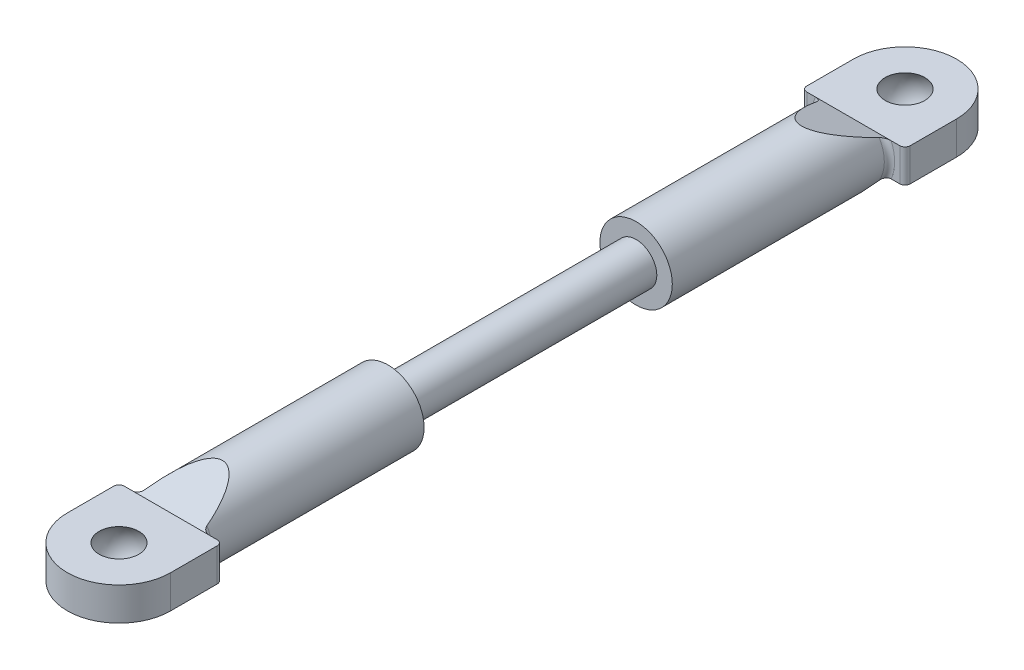
ISO-10303-21;
HEADER;
FILE_DESCRIPTION(('STEP AP214'),'2;1');
FILE_NAME('part.step','',(''),(''),'','','');
FILE_SCHEMA(('AUTOMOTIVE_DESIGN { 1 0 10303 214 1 1 1 1 }'));
ENDSEC;
DATA;
#1=APPLICATION_CONTEXT('core data for automotive mechanical design processes');
#2=APPLICATION_PROTOCOL_DEFINITION('international standard','automotive_design',2000,#1);
#3=PRODUCT_CONTEXT('',#1,'mechanical');
#4=PRODUCT('Part','Part','',(#3));
#5=PRODUCT_RELATED_PRODUCT_CATEGORY('part','',(#4));
#6=PRODUCT_DEFINITION_FORMATION('','',#4);
#7=PRODUCT_DEFINITION_CONTEXT('part definition',#1,'design');
#8=PRODUCT_DEFINITION('design','',#6,#7);
#9=PRODUCT_DEFINITION_SHAPE('','',#8);
#10=(LENGTH_UNIT() NAMED_UNIT(*) SI_UNIT(.MILLI.,.METRE.));
#11=(NAMED_UNIT(*) PLANE_ANGLE_UNIT() SI_UNIT($,.RADIAN.));
#12=(NAMED_UNIT(*) SI_UNIT($,.STERADIAN.) SOLID_ANGLE_UNIT());
#13=UNCERTAINTY_MEASURE_WITH_UNIT(LENGTH_MEASURE(1.E-05),#10,'distance_accuracy_value','');
#14=(GEOMETRIC_REPRESENTATION_CONTEXT(3) GLOBAL_UNCERTAINTY_ASSIGNED_CONTEXT((#13)) GLOBAL_UNIT_ASSIGNED_CONTEXT((#10,
#11,#12)) REPRESENTATION_CONTEXT('',''));
#15=CARTESIAN_POINT('',(0.,0.,0.));
#16=DIRECTION('',(0.,0.,1.));
#17=DIRECTION('',(1.,0.,0.));
#18=AXIS2_PLACEMENT_3D('',#15,#16,#17);
#19=CARTESIAN_POINT('',(0.,0.,-33.));
#20=DIRECTION('',(0.,0.,1.));
#21=DIRECTION('',(1.,0.,0.));
#22=AXIS2_PLACEMENT_3D('',#19,#20,#21);
#23=CYLINDRICAL_SURFACE('',#22,3.5);
#24=CARTESIAN_POINT('',(0.,0.,-12.));
#25=DIRECTION('',(0.,0.,1.));
#26=DIRECTION('',(1.,0.,0.));
#27=AXIS2_PLACEMENT_3D('',#24,#25,#26);
#28=CIRCLE('',#27,3.5);
#29=CARTESIAN_POINT('',(3.5,0.,-12.));
#30=VERTEX_POINT('',#29);
#31=EDGE_CURVE('E184',#30,#30,#28,.T.);
#32=ORIENTED_EDGE('',*,*,#31,.F.);
#33=EDGE_LOOP('',(#32));
#34=FACE_BOUND('',#33,.T.);
#35=CARTESIAN_POINT('',(0.,0.,-37.2105263157895));
#36=DIRECTION('',(0.,0.934783580588349,-0.355217760623573));
#37=DIRECTION('',(0.,0.355217760623573,0.934783580588349));
#38=AXIS2_PLACEMENT_3D('',#35,#36,#37);
#39=ELLIPSE('',#38,9.8531109307594,3.5);
#40=CARTESIAN_POINT('',(3.00764027104307,1.79,-32.5));
#41=VERTEX_POINT('',#40);
#42=CARTESIAN_POINT('',(-3.00764027104307,1.79,-32.5));
#43=VERTEX_POINT('',#42);
#44=EDGE_CURVE('E517',#41,#43,#39,.F.);
#45=ORIENTED_EDGE('',*,*,#44,.T.);
#46=CARTESIAN_POINT('',(0.,0.,-32.5));
#47=DIRECTION('',(0.,0.,1.));
#48=DIRECTION('',(1.,0.,0.));
#49=AXIS2_PLACEMENT_3D('',#46,#47,#48);
#50=CIRCLE('',#49,3.5);
#51=CARTESIAN_POINT('',(-3.00764027104307,-1.79,-32.5));
#52=VERTEX_POINT('',#51);
#53=EDGE_CURVE('E369',#43,#52,#50,.T.);
#54=ORIENTED_EDGE('',*,*,#53,.T.);
#55=CARTESIAN_POINT('',(0.,0.,-37.2105263157895));
#56=DIRECTION('',(0.,-0.934783580588349,-0.355217760623573));
#57=DIRECTION('',(0.,-0.355217760623573,0.934783580588349));
#58=AXIS2_PLACEMENT_3D('',#55,#56,#57);
#59=ELLIPSE('',#58,9.8531109307594,3.5);
#60=CARTESIAN_POINT('',(3.00764027104307,-1.79,-32.5));
#61=VERTEX_POINT('',#60);
#62=EDGE_CURVE('E208',#52,#61,#59,.F.);
#63=ORIENTED_EDGE('',*,*,#62,.T.);
#64=CARTESIAN_POINT('',(0.,0.,-32.5));
#65=DIRECTION('',(0.,0.,1.));
#66=DIRECTION('',(1.,0.,0.));
#67=AXIS2_PLACEMENT_3D('',#64,#65,#66);
#68=CIRCLE('',#67,3.5);
#69=EDGE_CURVE('E366',#61,#41,#68,.T.);
#70=ORIENTED_EDGE('',*,*,#69,.T.);
#71=EDGE_LOOP('',(#45,#54,#63,#70));
#72=FACE_BOUND('',#71,.T.);
#73=ADVANCED_FACE('F34',(#34,#72),#23,.T.);
#74=CARTESIAN_POINT('',(0.,0.,12.));
#75=DIRECTION('',(0.,0.,-1.));
#76=DIRECTION('',(-1.,0.,0.));
#77=AXIS2_PLACEMENT_3D('',#74,#75,#76);
#78=CYLINDRICAL_SURFACE('',#77,2.);
#79=CARTESIAN_POINT('',(0.,0.,12.));
#80=DIRECTION('',(0.,0.,1.));
#81=DIRECTION('',(1.,0.,0.));
#82=AXIS2_PLACEMENT_3D('',#79,#80,#81);
#83=CIRCLE('',#82,2.);
#84=CARTESIAN_POINT('',(2.,0.,12.));
#85=VERTEX_POINT('',#84);
#86=EDGE_CURVE('E267',#85,#85,#83,.T.);
#87=ORIENTED_EDGE('',*,*,#86,.F.);
#88=EDGE_LOOP('',(#87));
#89=FACE_BOUND('',#88,.T.);
#90=CARTESIAN_POINT('',(0.,0.,-12.));
#91=DIRECTION('',(0.,0.,-1.));
#92=DIRECTION('',(-1.,0.,0.));
#93=AXIS2_PLACEMENT_3D('',#90,#91,#92);
#94=CIRCLE('',#93,2.);
#95=CARTESIAN_POINT('',(-2.,0.,-12.));
#96=VERTEX_POINT('',#95);
#97=EDGE_CURVE('E219',#96,#96,#94,.T.);
#98=ORIENTED_EDGE('',*,*,#97,.F.);
#99=EDGE_LOOP('',(#98));
#100=FACE_BOUND('',#99,.T.);
#101=ADVANCED_FACE('F429',(#89,#100),#78,.T.);
#102=CARTESIAN_POINT('',(0.,0.,33.));
#103=DIRECTION('',(0.,0.,-1.));
#104=DIRECTION('',(-1.,0.,0.));
#105=AXIS2_PLACEMENT_3D('',#102,#103,#104);
#106=CYLINDRICAL_SURFACE('',#105,3.5);
#107=CARTESIAN_POINT('',(0.,0.,37.2105263157895));
#108=DIRECTION('',(0.,0.934783580588349,-0.355217760623573));
#109=DIRECTION('',(0.,-0.355217760623573,-0.934783580588349));
#110=AXIS2_PLACEMENT_3D('',#107,#108,#109);
#111=ELLIPSE('',#110,9.8531109307594,3.5);
#112=CARTESIAN_POINT('',(3.00764027104307,-1.79,32.5));
#113=VERTEX_POINT('',#112);
#114=CARTESIAN_POINT('',(-3.00764027104307,-1.79,32.5));
#115=VERTEX_POINT('',#114);
#116=EDGE_CURVE('E231',#113,#115,#111,.T.);
#117=ORIENTED_EDGE('',*,*,#116,.T.);
#118=CARTESIAN_POINT('',(0.,0.,32.5));
#119=DIRECTION('',(0.,0.,1.));
#120=DIRECTION('',(1.,0.,0.));
#121=AXIS2_PLACEMENT_3D('',#118,#119,#120);
#122=CIRCLE('',#121,3.5);
#123=CARTESIAN_POINT('',(-3.00764027104307,1.79,32.5));
#124=VERTEX_POINT('',#123);
#125=EDGE_CURVE('E288',#115,#124,#122,.F.);
#126=ORIENTED_EDGE('',*,*,#125,.T.);
#127=CARTESIAN_POINT('',(0.,0.,37.2105263157895));
#128=DIRECTION('',(0.,-0.934783580588349,-0.355217760623573));
#129=DIRECTION('',(0.,0.355217760623573,-0.934783580588349));
#130=AXIS2_PLACEMENT_3D('',#127,#128,#129);
#131=ELLIPSE('',#130,9.8531109307594,3.5);
#132=CARTESIAN_POINT('',(3.00764027104307,1.79,32.5));
#133=VERTEX_POINT('',#132);
#134=EDGE_CURVE('E228',#124,#133,#131,.T.);
#135=ORIENTED_EDGE('',*,*,#134,.T.);
#136=CARTESIAN_POINT('',(0.,0.,32.5));
#137=DIRECTION('',(0.,0.,1.));
#138=DIRECTION('',(1.,0.,0.));
#139=AXIS2_PLACEMENT_3D('',#136,#137,#138);
#140=CIRCLE('',#139,3.5);
#141=EDGE_CURVE('E286',#133,#113,#140,.F.);
#142=ORIENTED_EDGE('',*,*,#141,.T.);
#143=EDGE_LOOP('',(#117,#126,#135,#142));
#144=FACE_BOUND('',#143,.T.);
#145=CARTESIAN_POINT('',(0.,0.,12.));
#146=DIRECTION('',(0.,0.,1.));
#147=DIRECTION('',(1.,0.,0.));
#148=AXIS2_PLACEMENT_3D('',#145,#146,#147);
#149=CIRCLE('',#148,3.5);
#150=CARTESIAN_POINT('',(3.5,0.,12.));
#151=VERTEX_POINT('',#150);
#152=EDGE_CURVE('E264',#151,#151,#149,.T.);
#153=ORIENTED_EDGE('',*,*,#152,.T.);
#154=EDGE_LOOP('',(#153));
#155=FACE_BOUND('',#154,.T.);
#156=ADVANCED_FACE('F490',(#144,#155),#106,.T.);
#157=CARTESIAN_POINT('',(0.,0.,12.));
#158=DIRECTION('',(0.,0.,1.));
#159=DIRECTION('',(1.,0.,0.));
#160=AXIS2_PLACEMENT_3D('',#157,#158,#159);
#161=PLANE('',#160);
#162=ORIENTED_EDGE('',*,*,#86,.T.);
#163=EDGE_LOOP('',(#162));
#164=FACE_BOUND('',#163,.T.);
#165=ORIENTED_EDGE('',*,*,#152,.F.);
#166=EDGE_LOOP('',(#165));
#167=FACE_BOUND('',#166,.T.);
#168=ADVANCED_FACE('F493',(#164,#167),#161,.F.);
#169=CARTESIAN_POINT('',(4.99999999999997,1.6,33.));
#170=DIRECTION('',(0.,0.,1.));
#171=DIRECTION('',(1.,0.,0.));
#172=AXIS2_PLACEMENT_3D('',#169,#170,#171);
#173=PLANE('',#172);
#174=DIRECTION('',(-1.,0.,0.));
#175=VECTOR('',#174,1.);
#176=CARTESIAN_POINT('',(4.99999999999997,-1.6,33.));
#177=LINE('',#176,#175);
#178=CARTESIAN_POINT('',(-3.66606055596467,-1.6,33.));
#179=VERTEX_POINT('',#178);
#180=CARTESIAN_POINT('',(-4.50000000000003,-1.6,33.));
#181=VERTEX_POINT('',#180);
#182=EDGE_CURVE('E251',#179,#181,#177,.T.);
#183=ORIENTED_EDGE('',*,*,#182,.T.);
#184=DIRECTION('',(0.,-1.,0.));
#185=VECTOR('',#184,1.);
#186=CARTESIAN_POINT('',(-4.50000000000003,1.6,33.));
#187=LINE('',#186,#185);
#188=CARTESIAN_POINT('',(-4.50000000000003,1.6,33.));
#189=VERTEX_POINT('',#188);
#190=EDGE_CURVE('E280',#181,#189,#187,.F.);
#191=ORIENTED_EDGE('',*,*,#190,.T.);
#192=DIRECTION('',(-1.,0.,0.));
#193=VECTOR('',#192,1.);
#194=CARTESIAN_POINT('',(4.99999999999997,1.6,33.));
#195=LINE('',#194,#193);
#196=CARTESIAN_POINT('',(-3.66606055596467,1.6,33.));
#197=VERTEX_POINT('',#196);
#198=EDGE_CURVE('E238',#197,#189,#195,.T.);
#199=ORIENTED_EDGE('',*,*,#198,.F.);
#200=CARTESIAN_POINT('',(0.,0.,33.));
#201=DIRECTION('',(0.,0.,1.));
#202=DIRECTION('',(1.,0.,0.));
#203=AXIS2_PLACEMENT_3D('',#200,#201,#202);
#204=CIRCLE('',#203,4.);
#205=EDGE_CURVE('E277',#197,#179,#204,.T.);
#206=ORIENTED_EDGE('',*,*,#205,.T.);
#207=EDGE_LOOP('',(#183,#191,#199,#206));
#208=FACE_BOUND('',#207,.T.);
#209=ADVANCED_FACE('F458',(#208),#173,.F.);
#210=CARTESIAN_POINT('',(4.49999999999997,1.6,33.));
#211=VERTEX_POINT('',#210);
#212=CARTESIAN_POINT('',(3.66606055596467,1.6,33.));
#213=VERTEX_POINT('',#212);
#214=EDGE_CURVE('E240',#211,#213,#195,.T.);
#215=ORIENTED_EDGE('',*,*,#214,.F.);
#216=DIRECTION('',(0.,-1.,0.));
#217=VECTOR('',#216,1.);
#218=CARTESIAN_POINT('',(4.49999999999997,1.6,33.));
#219=LINE('',#218,#217);
#220=CARTESIAN_POINT('',(4.49999999999997,-1.6,33.));
#221=VERTEX_POINT('',#220);
#222=EDGE_CURVE('E293',#211,#221,#219,.T.);
#223=ORIENTED_EDGE('',*,*,#222,.T.);
#224=CARTESIAN_POINT('',(3.66606055596467,-1.6,33.));
#225=VERTEX_POINT('',#224);
#226=EDGE_CURVE('E252',#221,#225,#177,.T.);
#227=ORIENTED_EDGE('',*,*,#226,.T.);
#228=CARTESIAN_POINT('',(0.,0.,33.));
#229=DIRECTION('',(0.,0.,1.));
#230=DIRECTION('',(1.,0.,0.));
#231=AXIS2_PLACEMENT_3D('',#228,#229,#230);
#232=CIRCLE('',#231,4.);
#233=EDGE_CURVE('E290',#225,#213,#232,.T.);
#234=ORIENTED_EDGE('',*,*,#233,.T.);
#235=EDGE_LOOP('',(#215,#223,#227,#234));
#236=FACE_BOUND('',#235,.T.);
#237=ADVANCED_FACE('F486',(#236),#173,.F.);
#238=CARTESIAN_POINT('',(4.99999999999997,1.6,33.));
#239=DIRECTION('',(-1.,0.,0.));
#240=DIRECTION('',(0.,0.,1.));
#241=AXIS2_PLACEMENT_3D('',#238,#239,#240);
#242=PLANE('',#241);
#243=DIRECTION('',(0.,0.,-1.));
#244=VECTOR('',#243,1.);
#245=CARTESIAN_POINT('',(4.99999999999997,-1.6,33.));
#246=LINE('',#245,#244);
#247=CARTESIAN_POINT('',(4.99999999999997,-1.6,38.));
#248=VERTEX_POINT('',#247);
#249=CARTESIAN_POINT('',(4.99999999999997,-1.6,33.5));
#250=VERTEX_POINT('',#249);
#251=EDGE_CURVE('E234',#248,#250,#246,.T.);
#252=ORIENTED_EDGE('',*,*,#251,.T.);
#253=DIRECTION('',(0.,-1.,0.));
#254=VECTOR('',#253,1.);
#255=CARTESIAN_POINT('',(4.99999999999997,1.6,33.5));
#256=LINE('',#255,#254);
#257=CARTESIAN_POINT('',(4.99999999999997,1.6,33.5));
#258=VERTEX_POINT('',#257);
#259=EDGE_CURVE('E296',#250,#258,#256,.F.);
#260=ORIENTED_EDGE('',*,*,#259,.T.);
#261=DIRECTION('',(0.,0.,-1.));
#262=VECTOR('',#261,1.);
#263=CARTESIAN_POINT('',(4.99999999999997,1.6,33.));
#264=LINE('',#263,#262);
#265=CARTESIAN_POINT('',(4.99999999999997,1.6,38.));
#266=VERTEX_POINT('',#265);
#267=EDGE_CURVE('E235',#266,#258,#264,.T.);
#268=ORIENTED_EDGE('',*,*,#267,.F.);
#269=DIRECTION('',(0.,-1.,0.));
#270=VECTOR('',#269,1.);
#271=CARTESIAN_POINT('',(4.99999999999997,1.6,38.));
#272=LINE('',#271,#270);
#273=EDGE_CURVE('E248',#266,#248,#272,.T.);
#274=ORIENTED_EDGE('',*,*,#273,.T.);
#275=EDGE_LOOP('',(#252,#260,#268,#274));
#276=FACE_BOUND('',#275,.T.);
#277=ADVANCED_FACE('F480',(#276),#242,.F.);
#278=CARTESIAN_POINT('',(-5.00000000000003,1.6,33.));
#279=DIRECTION('',(1.,0.,0.));
#280=DIRECTION('',(0.,0.,-1.));
#281=AXIS2_PLACEMENT_3D('',#278,#279,#280);
#282=PLANE('',#281);
#283=DIRECTION('',(0.,0.,1.));
#284=VECTOR('',#283,1.);
#285=CARTESIAN_POINT('',(-5.00000000000003,1.6,33.));
#286=LINE('',#285,#284);
#287=CARTESIAN_POINT('',(-5.00000000000003,1.6,33.5));
#288=VERTEX_POINT('',#287);
#289=CARTESIAN_POINT('',(-5.00000000000003,1.6,38.));
#290=VERTEX_POINT('',#289);
#291=EDGE_CURVE('E243',#288,#290,#286,.T.);
#292=ORIENTED_EDGE('',*,*,#291,.F.);
#293=DIRECTION('',(0.,-1.,0.));
#294=VECTOR('',#293,1.);
#295=CARTESIAN_POINT('',(-5.00000000000003,1.6,33.5));
#296=LINE('',#295,#294);
#297=CARTESIAN_POINT('',(-5.00000000000003,-1.6,33.5));
#298=VERTEX_POINT('',#297);
#299=EDGE_CURVE('E270',#288,#298,#296,.T.);
#300=ORIENTED_EDGE('',*,*,#299,.T.);
#301=DIRECTION('',(0.,0.,1.));
#302=VECTOR('',#301,1.);
#303=CARTESIAN_POINT('',(-5.00000000000003,-1.6,33.));
#304=LINE('',#303,#302);
#305=CARTESIAN_POINT('',(-5.00000000000003,-1.6,38.));
#306=VERTEX_POINT('',#305);
#307=EDGE_CURVE('E255',#298,#306,#304,.T.);
#308=ORIENTED_EDGE('',*,*,#307,.T.);
#309=DIRECTION('',(0.,-1.,0.));
#310=VECTOR('',#309,1.);
#311=CARTESIAN_POINT('',(-5.00000000000003,1.6,38.));
#312=LINE('',#311,#310);
#313=EDGE_CURVE('E261',#290,#306,#312,.T.);
#314=ORIENTED_EDGE('',*,*,#313,.F.);
#315=EDGE_LOOP('',(#292,#300,#308,#314));
#316=FACE_BOUND('',#315,.T.);
#317=ADVANCED_FACE('F470',(#316),#282,.F.);
#318=CARTESIAN_POINT('',(0.,1.6,38.));
#319=DIRECTION('',(0.,-1.,0.));
#320=DIRECTION('',(0.,0.,-1.));
#321=AXIS2_PLACEMENT_3D('',#318,#319,#320);
#322=CYLINDRICAL_SURFACE('',#321,5.);
#323=CARTESIAN_POINT('',(0.,-1.6,38.));
#324=DIRECTION('',(0.,1.,0.));
#325=DIRECTION('',(0.,0.,1.));
#326=AXIS2_PLACEMENT_3D('',#323,#324,#325);
#327=CIRCLE('',#326,5.);
#328=EDGE_CURVE('E239',#306,#248,#327,.T.);
#329=ORIENTED_EDGE('',*,*,#328,.T.);
#330=ORIENTED_EDGE('',*,*,#273,.F.);
#331=CARTESIAN_POINT('',(0.,1.6,38.));
#332=DIRECTION('',(0.,1.,0.));
#333=DIRECTION('',(0.,0.,1.));
#334=AXIS2_PLACEMENT_3D('',#331,#332,#333);
#335=CIRCLE('',#334,5.);
#336=EDGE_CURVE('E246',#290,#266,#335,.T.);
#337=ORIENTED_EDGE('',*,*,#336,.F.);
#338=ORIENTED_EDGE('',*,*,#313,.T.);
#339=EDGE_LOOP('',(#329,#330,#337,#338));
#340=FACE_BOUND('',#339,.T.);
#341=ADVANCED_FACE('F476',(#340),#322,.T.);
#342=CARTESIAN_POINT('',(0.,1.6,38.));
#343=DIRECTION('',(0.,1.,0.));
#344=DIRECTION('',(0.,0.,1.));
#345=AXIS2_PLACEMENT_3D('',#342,#343,#344);
#346=PLANE('',#345);
#347=CARTESIAN_POINT('',(0.,1.6,38.));
#348=DIRECTION('',(0.,-1.,0.));
#349=DIRECTION('',(0.,0.,-1.));
#350=AXIS2_PLACEMENT_3D('',#347,#348,#349);
#351=CIRCLE('',#350,1.92093727122986);
#352=CARTESIAN_POINT('',(0.,1.6,36.0790627287702));
#353=VERTEX_POINT('',#352);
#354=EDGE_CURVE('E225',#353,#353,#351,.T.);
#355=ORIENTED_EDGE('',*,*,#354,.T.);
#356=EDGE_LOOP('',(#355));
#357=FACE_BOUND('',#356,.T.);
#358=ORIENTED_EDGE('',*,*,#198,.T.);
#359=CARTESIAN_POINT('',(-4.50000000000003,1.6,33.5));
#360=DIRECTION('',(0.,1.,0.));
#361=DIRECTION('',(0.,0.,1.));
#362=AXIS2_PLACEMENT_3D('',#359,#360,#361);
#363=CIRCLE('',#362,0.5);
#364=EDGE_CURVE('E284',#189,#288,#363,.T.);
#365=ORIENTED_EDGE('',*,*,#364,.T.);
#366=ORIENTED_EDGE('',*,*,#291,.T.);
#367=ORIENTED_EDGE('',*,*,#336,.T.);
#368=ORIENTED_EDGE('',*,*,#267,.T.);
#369=CARTESIAN_POINT('',(4.49999999999997,1.6,33.5));
#370=DIRECTION('',(0.,1.,0.));
#371=DIRECTION('',(0.,0.,1.));
#372=AXIS2_PLACEMENT_3D('',#369,#370,#371);
#373=CIRCLE('',#372,0.5);
#374=EDGE_CURVE('E282',#258,#211,#373,.T.);
#375=ORIENTED_EDGE('',*,*,#374,.T.);
#376=ORIENTED_EDGE('',*,*,#214,.T.);
#377=EDGE_CURVE('E244',#213,#197,#195,.T.);
#378=ORIENTED_EDGE('',*,*,#377,.T.);
#379=EDGE_LOOP('',(#358,#365,#366,#367,#368,#375,#376,#378));
#380=FACE_BOUND('',#379,.T.);
#381=ADVANCED_FACE('F466',(#357,#380),#346,.T.);
#382=CARTESIAN_POINT('',(0.,-1.6,38.));
#383=DIRECTION('',(0.,1.,0.));
#384=DIRECTION('',(0.,0.,1.));
#385=AXIS2_PLACEMENT_3D('',#382,#383,#384);
#386=PLANE('',#385);
#387=CARTESIAN_POINT('',(0.,-1.6,38.));
#388=DIRECTION('',(0.,-1.,0.));
#389=DIRECTION('',(0.,0.,-1.));
#390=AXIS2_PLACEMENT_3D('',#387,#388,#389);
#391=CIRCLE('',#390,1.92093727122986);
#392=CARTESIAN_POINT('',(0.,-1.6,36.0790627287702));
#393=VERTEX_POINT('',#392);
#394=EDGE_CURVE('E222',#393,#393,#391,.T.);
#395=ORIENTED_EDGE('',*,*,#394,.F.);
#396=EDGE_LOOP('',(#395));
#397=FACE_BOUND('',#396,.T.);
#398=ORIENTED_EDGE('',*,*,#307,.F.);
#399=CARTESIAN_POINT('',(-4.50000000000003,-1.6,33.5));
#400=DIRECTION('',(0.,1.,0.));
#401=DIRECTION('',(0.,0.,1.));
#402=AXIS2_PLACEMENT_3D('',#399,#400,#401);
#403=CIRCLE('',#402,0.5);
#404=EDGE_CURVE('E275',#298,#181,#403,.F.);
#405=ORIENTED_EDGE('',*,*,#404,.T.);
#406=ORIENTED_EDGE('',*,*,#182,.F.);
#407=EDGE_CURVE('E256',#225,#179,#177,.T.);
#408=ORIENTED_EDGE('',*,*,#407,.F.);
#409=ORIENTED_EDGE('',*,*,#226,.F.);
#410=CARTESIAN_POINT('',(4.49999999999997,-1.6,33.5));
#411=DIRECTION('',(0.,1.,0.));
#412=DIRECTION('',(0.,0.,1.));
#413=AXIS2_PLACEMENT_3D('',#410,#411,#412);
#414=CIRCLE('',#413,0.5);
#415=EDGE_CURVE('E273',#221,#250,#414,.F.);
#416=ORIENTED_EDGE('',*,*,#415,.T.);
#417=ORIENTED_EDGE('',*,*,#251,.F.);
#418=ORIENTED_EDGE('',*,*,#328,.F.);
#419=EDGE_LOOP('',(#398,#405,#406,#408,#409,#416,#417,#418));
#420=FACE_BOUND('',#419,.T.);
#421=ADVANCED_FACE('F443',(#397,#420),#386,.F.);
#422=CARTESIAN_POINT('',(-5.00000000000003,-3.5,28.));
#423=DIRECTION('',(0.,0.934783580588349,-0.355217760623573));
#424=DIRECTION('',(0.,0.355217760623573,0.934783580588349));
#425=AXIS2_PLACEMENT_3D('',#422,#423,#424);
#426=PLANE('',#425);
#427=ORIENTED_EDGE('',*,*,#116,.F.);
#428=CARTESIAN_POINT('',(3.00764027104307,-1.79,32.5));
#429=CARTESIAN_POINT('',(3.01501660801302,-1.77766028795213,32.5324729264418));
#430=CARTESIAN_POINT('',(3.02572054444839,-1.76562370557432,32.5641481432255));
#431=CARTESIAN_POINT('',(3.05268143397384,-1.74243941655702,32.6251594301131));
#432=CARTESIAN_POINT('',(3.06890462643524,-1.73128680248826,32.6545084145046));
#433=CARTESIAN_POINT('',(3.10582578109096,-1.71005107968239,32.7103918955726));
#434=CARTESIAN_POINT('',(3.12650175541777,-1.69996306618932,32.7369392995018));
#435=CARTESIAN_POINT('',(3.17173377932213,-1.68091062474513,32.7870773033023));
#436=CARTESIAN_POINT('',(3.1963000098391,-1.67194925885705,32.810659845113));
#437=CARTESIAN_POINT('',(3.25308702665305,-1.65394324157303,32.8580441011236));
#438=CARTESIAN_POINT('',(3.28590126291054,-1.64513316555967,32.8812285116851));
#439=CARTESIAN_POINT('',(3.35512262024705,-1.62958502321958,32.922144675738));
#440=CARTESIAN_POINT('',(3.39152193222908,-1.62284257946172,32.939887948785));
#441=CARTESIAN_POINT('',(3.46667654312686,-1.61181855552478,32.9688985380927));
#442=CARTESIAN_POINT('',(3.50539569079469,-1.60750655943475,32.9802458962243));
#443=CARTESIAN_POINT('',(3.58468972563839,-1.60158887924979,32.9958187388163));
#444=CARTESIAN_POINT('',(3.62527552224046,-1.60000196579963,32.9999948268431));
#445=CARTESIAN_POINT('',(3.66606055596467,-1.6,33.));
#446=B_SPLINE_CURVE_WITH_KNOTS('',3,(#428,#429,#430,#431,#432,#433,#434,#435,#436,#437,#438,
#439,#440,#441,#442,#443,#444,#445),.UNSPECIFIED.,.F.,.F.,(4,2,2,2,2,2,2,2,4),(0.,
0.106167992198196,0.211697907824557,0.316718199165379,0.422018018143722,0.544850735918064,
0.667421577236031,0.788422358006247,0.910253310178006),.UNSPECIFIED.);
#447=EDGE_CURVE('E344',#113,#225,#446,.T.);
#448=ORIENTED_EDGE('',*,*,#447,.T.);
#449=ORIENTED_EDGE('',*,*,#407,.T.);
#450=CARTESIAN_POINT('',(-3.66606055596467,-1.6,33.));
#451=CARTESIAN_POINT('',(-3.63078063888977,-1.60000001056058,32.999999972209));
#452=CARTESIAN_POINT('',(-3.5956179181408,-1.60118986581098,32.9968687741816));
#453=CARTESIAN_POINT('',(-3.52655388189509,-1.60567025143002,32.9850782857105));
#454=CARTESIAN_POINT('',(-3.49264665949915,-1.60894911259673,32.9764497036928));
#455=CARTESIAN_POINT('',(-3.42683574135487,-1.61731864154893,32.9544246275028));
#456=CARTESIAN_POINT('',(-3.39492497711937,-1.62240243525609,32.9410462230103));
#457=CARTESIAN_POINT('',(-3.33346675755787,-1.63416518792784,32.9100916107162));
#458=CARTESIAN_POINT('',(-3.30392365430699,-1.64084699836385,32.8925078990425));
#459=CARTESIAN_POINT('',(-3.24361803739982,-1.65669629654687,32.8507992196135));
#460=CARTESIAN_POINT('',(-3.2133145497666,-1.66608478340738,32.8260926752437));
#461=CARTESIAN_POINT('',(-3.15729695298565,-1.68646854640408,32.7724511936735));
#462=CARTESIAN_POINT('',(-3.13158499781672,-1.69746457229264,32.7435142834404));
#463=CARTESIAN_POINT('',(-3.08849280363674,-1.71942769351274,32.6857165960191));
#464=CARTESIAN_POINT('',(-3.07048210952563,-1.73023882163715,32.6572662588496));
#465=CARTESIAN_POINT('',(-3.03967295120166,-1.7527379284266,32.5980580830879));
#466=CARTESIAN_POINT('',(-3.02685556067101,-1.76442253590269,32.5673091160455));
#467=CARTESIAN_POINT('',(-3.01354455450079,-1.7809023956061,32.5239410641945));
#468=CARTESIAN_POINT('',(-3.01035806349222,-1.78543358828867,32.5120168729246));
#469=CARTESIAN_POINT('',(-3.00764027104306,-1.79,32.5));
#470=B_SPLINE_CURVE_WITH_KNOTS('',3,(#450,#451,#452,#453,#454,#455,#456,#457,#458,#459,#460,
#461,#462,#463,#464,#465,#466,#467,#468,#469),.UNSPECIFIED.,.F.,.F.,(4,2,2,2,2,2,2,2,2,4),(0.,
0.105514918398725,0.210445536564004,0.314980739690671,0.419703883801088,0.539819680998129,
0.659991679707302,0.765692662085826,0.871004889168675,0.9104205379135),.UNSPECIFIED.);
#471=EDGE_CURVE('E298',#179,#115,#470,.T.);
#472=ORIENTED_EDGE('',*,*,#471,.T.);
#473=EDGE_LOOP('',(#427,#448,#449,#472));
#474=FACE_BOUND('',#473,.T.);
#475=ADVANCED_FACE('F313',(#474),#426,.F.);
#476=CARTESIAN_POINT('',(-5.00000000000003,3.5,28.));
#477=DIRECTION('',(0.,-0.934783580588349,-0.355217760623573));
#478=DIRECTION('',(0.,0.355217760623573,-0.934783580588349));
#479=AXIS2_PLACEMENT_3D('',#476,#477,#478);
#480=PLANE('',#479);
#481=ORIENTED_EDGE('',*,*,#134,.F.);
#482=CARTESIAN_POINT('',(-3.00764027104307,1.79,32.5));
#483=CARTESIAN_POINT('',(-3.01501660801302,1.77766028795213,32.5324729264418));
#484=CARTESIAN_POINT('',(-3.02572054444839,1.76562370557432,32.5641481432255));
#485=CARTESIAN_POINT('',(-3.05268143397384,1.74243941655702,32.6251594301131));
#486=CARTESIAN_POINT('',(-3.06890462643524,1.73128680248826,32.6545084145046));
#487=CARTESIAN_POINT('',(-3.10582578109096,1.71005107968239,32.7103918955726));
#488=CARTESIAN_POINT('',(-3.12650175541777,1.69996306618932,32.7369392995018));
#489=CARTESIAN_POINT('',(-3.17173377932213,1.68091062474513,32.7870773033023));
#490=CARTESIAN_POINT('',(-3.1963000098391,1.67194925885705,32.810659845113));
#491=CARTESIAN_POINT('',(-3.25308702665305,1.65394324157303,32.8580441011236));
#492=CARTESIAN_POINT('',(-3.28590126291054,1.64513316555967,32.8812285116851));
#493=CARTESIAN_POINT('',(-3.35512262024705,1.62958502321958,32.922144675738));
#494=CARTESIAN_POINT('',(-3.39152193222908,1.62284257946172,32.939887948785));
#495=CARTESIAN_POINT('',(-3.46667654312686,1.61181855552478,32.9688985380927));
#496=CARTESIAN_POINT('',(-3.50539569079469,1.60750655943475,32.9802458962243));
#497=CARTESIAN_POINT('',(-3.58468972563839,1.60158887924979,32.9958187388163));
#498=CARTESIAN_POINT('',(-3.62527552224046,1.60000196579963,32.9999948268431));
#499=CARTESIAN_POINT('',(-3.66606055596467,1.6,33.));
#500=B_SPLINE_CURVE_WITH_KNOTS('',3,(#482,#483,#484,#485,#486,#487,#488,#489,#490,#491,#492,
#493,#494,#495,#496,#497,#498,#499),.UNSPECIFIED.,.F.,.F.,(4,2,2,2,2,2,2,2,4),(0.,
0.106167992198196,0.211697907824557,0.316718199165379,0.422018018143722,0.544850735918064,
0.667421577236031,0.788422358006247,0.910253310178006),.UNSPECIFIED.);
#501=EDGE_CURVE('E306',#124,#197,#500,.T.);
#502=ORIENTED_EDGE('',*,*,#501,.T.);
#503=ORIENTED_EDGE('',*,*,#377,.F.);
#504=CARTESIAN_POINT('',(3.66606055596467,1.6,33.));
#505=CARTESIAN_POINT('',(3.63078063888977,1.60000001056058,32.999999972209));
#506=CARTESIAN_POINT('',(3.5956179181408,1.60118986581098,32.9968687741816));
#507=CARTESIAN_POINT('',(3.52655388189509,1.60567025143002,32.9850782857105));
#508=CARTESIAN_POINT('',(3.49264665949915,1.60894911259673,32.9764497036928));
#509=CARTESIAN_POINT('',(3.42683574135487,1.61731864154893,32.9544246275028));
#510=CARTESIAN_POINT('',(3.39492497711937,1.62240243525609,32.9410462230103));
#511=CARTESIAN_POINT('',(3.33346675755787,1.63416518792784,32.9100916107162));
#512=CARTESIAN_POINT('',(3.30392365430699,1.64084699836385,32.8925078990425));
#513=CARTESIAN_POINT('',(3.24361803739982,1.65669629654687,32.8507992196135));
#514=CARTESIAN_POINT('',(3.2133145497666,1.66608478340738,32.8260926752437));
#515=CARTESIAN_POINT('',(3.15729695298565,1.68646854640408,32.7724511936735));
#516=CARTESIAN_POINT('',(3.13158499781672,1.69746457229264,32.7435142834404));
#517=CARTESIAN_POINT('',(3.08849280363674,1.71942769351274,32.6857165960191));
#518=CARTESIAN_POINT('',(3.07048210952563,1.73023882163715,32.6572662588496));
#519=CARTESIAN_POINT('',(3.03967295120166,1.7527379284266,32.5980580830879));
#520=CARTESIAN_POINT('',(3.02685556067101,1.76442253590269,32.5673091160455));
#521=CARTESIAN_POINT('',(3.01354455450079,1.7809023956061,32.5239410641945));
#522=CARTESIAN_POINT('',(3.01035806349222,1.78543358828867,32.5120168729246));
#523=CARTESIAN_POINT('',(3.00764027104306,1.79,32.5));
#524=B_SPLINE_CURVE_WITH_KNOTS('',3,(#504,#505,#506,#507,#508,#509,#510,#511,#512,#513,#514,
#515,#516,#517,#518,#519,#520,#521,#522,#523),.UNSPECIFIED.,.F.,.F.,(4,2,2,2,2,2,2,2,2,4),(0.,
0.105514918398725,0.210445536564004,0.314980739690672,0.419703883801088,0.539819680998129,
0.659991679707302,0.765692662085826,0.871004889168675,0.910420537913499),.UNSPECIFIED.);
#525=EDGE_CURVE('E338',#213,#133,#524,.T.);
#526=ORIENTED_EDGE('',*,*,#525,.T.);
#527=EDGE_LOOP('',(#481,#502,#503,#526));
#528=FACE_BOUND('',#527,.T.);
#529=ADVANCED_FACE('F433',(#528),#480,.F.);
#530=CARTESIAN_POINT('',(-4.50000000000003,1.6,33.5));
#531=DIRECTION('',(0.,-1.,0.));
#532=DIRECTION('',(0.,0.,-1.));
#533=AXIS2_PLACEMENT_3D('',#530,#531,#532);
#534=CYLINDRICAL_SURFACE('',#533,0.5);
#535=ORIENTED_EDGE('',*,*,#364,.F.);
#536=ORIENTED_EDGE('',*,*,#190,.F.);
#537=ORIENTED_EDGE('',*,*,#404,.F.);
#538=ORIENTED_EDGE('',*,*,#299,.F.);
#539=EDGE_LOOP('',(#535,#536,#537,#538));
#540=FACE_BOUND('',#539,.T.);
#541=ADVANCED_FACE('F322',(#540),#534,.T.);
#542=CARTESIAN_POINT('',(0.,0.,32.5));
#543=DIRECTION('',(0.,0.,1.));
#544=DIRECTION('',(1.,0.,0.));
#545=AXIS2_PLACEMENT_3D('',#542,#543,#544);
#546=TOROIDAL_SURFACE('',#545,4.,0.5);
#547=ORIENTED_EDGE('',*,*,#501,.F.);
#548=ORIENTED_EDGE('',*,*,#125,.F.);
#549=ORIENTED_EDGE('',*,*,#471,.F.);
#550=ORIENTED_EDGE('',*,*,#205,.F.);
#551=EDGE_LOOP('',(#547,#548,#549,#550));
#552=FACE_BOUND('',#551,.T.);
#553=ADVANCED_FACE('F316',(#552),#546,.F.);
#554=CARTESIAN_POINT('',(4.49999999999997,1.6,33.5));
#555=DIRECTION('',(0.,-1.,0.));
#556=DIRECTION('',(0.,0.,-1.));
#557=AXIS2_PLACEMENT_3D('',#554,#555,#556);
#558=CYLINDRICAL_SURFACE('',#557,0.5);
#559=ORIENTED_EDGE('',*,*,#374,.F.);
#560=ORIENTED_EDGE('',*,*,#259,.F.);
#561=ORIENTED_EDGE('',*,*,#415,.F.);
#562=ORIENTED_EDGE('',*,*,#222,.F.);
#563=EDGE_LOOP('',(#559,#560,#561,#562));
#564=FACE_BOUND('',#563,.T.);
#565=ADVANCED_FACE('F321',(#564),#558,.T.);
#566=CARTESIAN_POINT('',(0.,0.,32.5));
#567=DIRECTION('',(0.,0.,1.));
#568=DIRECTION('',(1.,0.,0.));
#569=AXIS2_PLACEMENT_3D('',#566,#567,#568);
#570=TOROIDAL_SURFACE('',#569,4.,0.5);
#571=ORIENTED_EDGE('',*,*,#447,.F.);
#572=ORIENTED_EDGE('',*,*,#141,.F.);
#573=ORIENTED_EDGE('',*,*,#525,.F.);
#574=ORIENTED_EDGE('',*,*,#233,.F.);
#575=EDGE_LOOP('',(#571,#572,#573,#574));
#576=FACE_BOUND('',#575,.T.);
#577=ADVANCED_FACE('F328',(#576),#570,.F.);
#578=CARTESIAN_POINT('',(0.,0.,38.));
#579=DIRECTION('',(0.,-1.,0.));
#580=DIRECTION('',(0.,0.,1.));
#581=AXIS2_PLACEMENT_3D('',#578,#579,#580);
#582=SPHERICAL_SURFACE('',#581,2.5);
#583=ORIENTED_EDGE('',*,*,#394,.T.);
#584=EDGE_LOOP('',(#583));
#585=FACE_BOUND('',#584,.T.);
#586=ORIENTED_EDGE('',*,*,#354,.F.);
#587=EDGE_LOOP('',(#586));
#588=FACE_BOUND('',#587,.T.);
#589=ADVANCED_FACE('F333',(#585,#588),#582,.F.);
#590=CARTESIAN_POINT('',(0.,0.,-12.));
#591=DIRECTION('',(0.,0.,-1.));
#592=DIRECTION('',(1.,0.,0.));
#593=AXIS2_PLACEMENT_3D('',#590,#591,#592);
#594=PLANE('',#593);
#595=ORIENTED_EDGE('',*,*,#97,.T.);
#596=EDGE_LOOP('',(#595));
#597=FACE_BOUND('',#596,.T.);
#598=ORIENTED_EDGE('',*,*,#31,.T.);
#599=EDGE_LOOP('',(#598));
#600=FACE_BOUND('',#599,.T.);
#601=ADVANCED_FACE('F415',(#597,#600),#594,.F.);
#602=CARTESIAN_POINT('',(4.99999999999997,1.6,-33.));
#603=DIRECTION('',(0.,0.,1.));
#604=DIRECTION('',(1.,0.,0.));
#605=AXIS2_PLACEMENT_3D('',#602,#603,#604);
#606=PLANE('',#605);
#607=DIRECTION('',(-1.,0.,0.));
#608=VECTOR('',#607,1.);
#609=CARTESIAN_POINT('',(4.99999999999997,1.6,-33.));
#610=LINE('',#609,#608);
#611=CARTESIAN_POINT('',(-3.66606055596467,1.6,-33.));
#612=VERTEX_POINT('',#611);
#613=CARTESIAN_POINT('',(-4.50000000000003,1.6,-33.));
#614=VERTEX_POINT('',#613);
#615=EDGE_CURVE('E200',#612,#614,#610,.T.);
#616=ORIENTED_EDGE('',*,*,#615,.T.);
#617=DIRECTION('',(0.,-1.,0.));
#618=VECTOR('',#617,1.);
#619=CARTESIAN_POINT('',(-4.50000000000003,1.6,-33.));
#620=LINE('',#619,#618);
#621=CARTESIAN_POINT('',(-4.50000000000003,-1.6,-33.));
#622=VERTEX_POINT('',#621);
#623=EDGE_CURVE('E354',#614,#622,#620,.T.);
#624=ORIENTED_EDGE('',*,*,#623,.T.);
#625=DIRECTION('',(-1.,0.,0.));
#626=VECTOR('',#625,1.);
#627=CARTESIAN_POINT('',(4.99999999999997,-1.6,-33.));
#628=LINE('',#627,#626);
#629=CARTESIAN_POINT('',(-3.66606055596467,-1.6,-33.));
#630=VERTEX_POINT('',#629);
#631=EDGE_CURVE('E212',#630,#622,#628,.T.);
#632=ORIENTED_EDGE('',*,*,#631,.F.);
#633=CARTESIAN_POINT('',(0.,0.,-33.));
#634=DIRECTION('',(0.,0.,1.));
#635=DIRECTION('',(1.,0.,0.));
#636=AXIS2_PLACEMENT_3D('',#633,#634,#635);
#637=CIRCLE('',#636,4.);
#638=EDGE_CURVE('E351',#630,#612,#637,.F.);
#639=ORIENTED_EDGE('',*,*,#638,.T.);
#640=EDGE_LOOP('',(#616,#624,#632,#639));
#641=FACE_BOUND('',#640,.T.);
#642=ADVANCED_FACE('F411',(#641),#606,.T.);
#643=CARTESIAN_POINT('',(4.49999999999997,-1.6,-33.));
#644=VERTEX_POINT('',#643);
#645=CARTESIAN_POINT('',(3.66606055596467,-1.6,-33.));
#646=VERTEX_POINT('',#645);
#647=EDGE_CURVE('E193',#644,#646,#628,.T.);
#648=ORIENTED_EDGE('',*,*,#647,.F.);
#649=DIRECTION('',(0.,-1.,0.));
#650=VECTOR('',#649,1.);
#651=CARTESIAN_POINT('',(4.49999999999997,1.6,-33.));
#652=LINE('',#651,#650);
#653=CARTESIAN_POINT('',(4.49999999999997,1.6,-33.));
#654=VERTEX_POINT('',#653);
#655=EDGE_CURVE('E377',#644,#654,#652,.F.);
#656=ORIENTED_EDGE('',*,*,#655,.T.);
#657=CARTESIAN_POINT('',(3.66606055596467,1.6,-33.));
#658=VERTEX_POINT('',#657);
#659=EDGE_CURVE('E204',#654,#658,#610,.T.);
#660=ORIENTED_EDGE('',*,*,#659,.T.);
#661=CARTESIAN_POINT('',(0.,0.,-33.));
#662=DIRECTION('',(0.,0.,1.));
#663=DIRECTION('',(1.,0.,0.));
#664=AXIS2_PLACEMENT_3D('',#661,#662,#663);
#665=CIRCLE('',#664,4.);
#666=EDGE_CURVE('E374',#658,#646,#665,.F.);
#667=ORIENTED_EDGE('',*,*,#666,.T.);
#668=EDGE_LOOP('',(#648,#656,#660,#667));
#669=FACE_BOUND('',#668,.T.);
#670=ADVANCED_FACE('F414',(#669),#606,.T.);
#671=CARTESIAN_POINT('',(4.99999999999997,1.6,-33.));
#672=DIRECTION('',(1.,0.,0.));
#673=DIRECTION('',(0.,0.,-1.));
#674=AXIS2_PLACEMENT_3D('',#671,#672,#673);
#675=PLANE('',#674);
#676=DIRECTION('',(0.,0.,1.));
#677=VECTOR('',#676,1.);
#678=CARTESIAN_POINT('',(4.99999999999997,1.6,-33.));
#679=LINE('',#678,#677);
#680=CARTESIAN_POINT('',(4.99999999999997,1.6,-38.));
#681=VERTEX_POINT('',#680);
#682=CARTESIAN_POINT('',(4.99999999999997,1.6,-33.5));
#683=VERTEX_POINT('',#682);
#684=EDGE_CURVE('E176',#681,#683,#679,.T.);
#685=ORIENTED_EDGE('',*,*,#684,.T.);
#686=DIRECTION('',(0.,-1.,0.));
#687=VECTOR('',#686,1.);
#688=CARTESIAN_POINT('',(4.99999999999997,1.6,-33.5));
#689=LINE('',#688,#687);
#690=CARTESIAN_POINT('',(4.99999999999997,-1.6,-33.5));
#691=VERTEX_POINT('',#690);
#692=EDGE_CURVE('E372',#683,#691,#689,.T.);
#693=ORIENTED_EDGE('',*,*,#692,.T.);
#694=DIRECTION('',(0.,0.,1.));
#695=VECTOR('',#694,1.);
#696=CARTESIAN_POINT('',(4.99999999999997,-1.6,-33.));
#697=LINE('',#696,#695);
#698=CARTESIAN_POINT('',(4.99999999999997,-1.6,-38.));
#699=VERTEX_POINT('',#698);
#700=EDGE_CURVE('E179',#699,#691,#697,.T.);
#701=ORIENTED_EDGE('',*,*,#700,.F.);
#702=DIRECTION('',(0.,-1.,0.));
#703=VECTOR('',#702,1.);
#704=CARTESIAN_POINT('',(4.99999999999997,1.6,-38.));
#705=LINE('',#704,#703);
#706=EDGE_CURVE('E172',#681,#699,#705,.T.);
#707=ORIENTED_EDGE('',*,*,#706,.F.);
#708=EDGE_LOOP('',(#685,#693,#701,#707));
#709=FACE_BOUND('',#708,.T.);
#710=ADVANCED_FACE('F174',(#709),#675,.T.);
#711=CARTESIAN_POINT('',(0.,1.6,-38.));
#712=DIRECTION('',(0.,-1.,0.));
#713=DIRECTION('',(0.,0.,-1.));
#714=AXIS2_PLACEMENT_3D('',#711,#712,#713);
#715=CYLINDRICAL_SURFACE('',#714,5.);
#716=CARTESIAN_POINT('',(0.,-1.6,-38.));
#717=DIRECTION('',(0.,-1.,0.));
#718=DIRECTION('',(0.,0.,-1.));
#719=AXIS2_PLACEMENT_3D('',#716,#717,#718);
#720=CIRCLE('',#719,5.);
#721=CARTESIAN_POINT('',(-5.00000000000003,-1.6,-38.));
#722=VERTEX_POINT('',#721);
#723=EDGE_CURVE('E207',#722,#699,#720,.T.);
#724=ORIENTED_EDGE('',*,*,#723,.F.);
#725=DIRECTION('',(0.,-1.,0.));
#726=VECTOR('',#725,1.);
#727=CARTESIAN_POINT('',(-5.00000000000003,1.6,-38.));
#728=LINE('',#727,#726);
#729=CARTESIAN_POINT('',(-5.00000000000003,1.6,-38.));
#730=VERTEX_POINT('',#729);
#731=EDGE_CURVE('E185',#730,#722,#728,.T.);
#732=ORIENTED_EDGE('',*,*,#731,.F.);
#733=CARTESIAN_POINT('',(0.,1.6,-38.));
#734=DIRECTION('',(0.,-1.,0.));
#735=DIRECTION('',(0.,0.,-1.));
#736=AXIS2_PLACEMENT_3D('',#733,#734,#735);
#737=CIRCLE('',#736,5.);
#738=EDGE_CURVE('E190',#730,#681,#737,.T.);
#739=ORIENTED_EDGE('',*,*,#738,.T.);
#740=ORIENTED_EDGE('',*,*,#706,.T.);
#741=EDGE_LOOP('',(#724,#732,#739,#740));
#742=FACE_BOUND('',#741,.T.);
#743=ADVANCED_FACE('F196',(#742),#715,.T.);
#744=CARTESIAN_POINT('',(-5.00000000000003,1.6,-33.));
#745=DIRECTION('',(-1.,0.,0.));
#746=DIRECTION('',(0.,0.,1.));
#747=AXIS2_PLACEMENT_3D('',#744,#745,#746);
#748=PLANE('',#747);
#749=DIRECTION('',(0.,0.,-1.));
#750=VECTOR('',#749,1.);
#751=CARTESIAN_POINT('',(-5.00000000000003,-1.6,-33.));
#752=LINE('',#751,#750);
#753=CARTESIAN_POINT('',(-5.00000000000003,-1.6,-33.5));
#754=VERTEX_POINT('',#753);
#755=EDGE_CURVE('E210',#754,#722,#752,.T.);
#756=ORIENTED_EDGE('',*,*,#755,.F.);
#757=DIRECTION('',(0.,-1.,0.));
#758=VECTOR('',#757,1.);
#759=CARTESIAN_POINT('',(-5.00000000000003,1.6,-33.5));
#760=LINE('',#759,#758);
#761=CARTESIAN_POINT('',(-5.00000000000003,1.6,-33.5));
#762=VERTEX_POINT('',#761);
#763=EDGE_CURVE('E361',#754,#762,#760,.F.);
#764=ORIENTED_EDGE('',*,*,#763,.T.);
#765=DIRECTION('',(0.,0.,-1.));
#766=VECTOR('',#765,1.);
#767=CARTESIAN_POINT('',(-5.00000000000003,1.6,-33.));
#768=LINE('',#767,#766);
#769=EDGE_CURVE('E198',#762,#730,#768,.T.);
#770=ORIENTED_EDGE('',*,*,#769,.T.);
#771=ORIENTED_EDGE('',*,*,#731,.T.);
#772=EDGE_LOOP('',(#756,#764,#770,#771));
#773=FACE_BOUND('',#772,.T.);
#774=ADVANCED_FACE('F406',(#773),#748,.T.);
#775=CARTESIAN_POINT('',(0.,1.6,-38.));
#776=DIRECTION('',(0.,1.,0.));
#777=DIRECTION('',(0.,0.,-1.));
#778=AXIS2_PLACEMENT_3D('',#775,#776,#777);
#779=PLANE('',#778);
#780=CARTESIAN_POINT('',(0.,1.6,-38.));
#781=DIRECTION('',(0.,1.,0.));
#782=DIRECTION('',(0.,0.,1.));
#783=AXIS2_PLACEMENT_3D('',#780,#781,#782);
#784=CIRCLE('',#783,1.92093727122986);
#785=CARTESIAN_POINT('',(0.,1.6,-36.0790627287702));
#786=VERTEX_POINT('',#785);
#787=EDGE_CURVE('E524',#786,#786,#784,.T.);
#788=ORIENTED_EDGE('',*,*,#787,.F.);
#789=EDGE_LOOP('',(#788));
#790=FACE_BOUND('',#789,.T.);
#791=ORIENTED_EDGE('',*,*,#769,.F.);
#792=CARTESIAN_POINT('',(-4.50000000000003,1.6,-33.5));
#793=DIRECTION('',(0.,1.,0.));
#794=DIRECTION('',(0.,0.,1.));
#795=AXIS2_PLACEMENT_3D('',#792,#793,#794);
#796=CIRCLE('',#795,0.5);
#797=EDGE_CURVE('E364',#762,#614,#796,.T.);
#798=ORIENTED_EDGE('',*,*,#797,.T.);
#799=ORIENTED_EDGE('',*,*,#615,.F.);
#800=EDGE_CURVE('E56',#658,#612,#610,.T.);
#801=ORIENTED_EDGE('',*,*,#800,.F.);
#802=ORIENTED_EDGE('',*,*,#659,.F.);
#803=CARTESIAN_POINT('',(4.49999999999997,1.6,-33.5));
#804=DIRECTION('',(0.,1.,0.));
#805=DIRECTION('',(0.,0.,1.));
#806=AXIS2_PLACEMENT_3D('',#803,#804,#805);
#807=CIRCLE('',#806,0.5);
#808=EDGE_CURVE('E192',#654,#683,#807,.T.);
#809=ORIENTED_EDGE('',*,*,#808,.T.);
#810=ORIENTED_EDGE('',*,*,#684,.F.);
#811=ORIENTED_EDGE('',*,*,#738,.F.);
#812=EDGE_LOOP('',(#791,#798,#799,#801,#802,#809,#810,#811));
#813=FACE_BOUND('',#812,.T.);
#814=ADVANCED_FACE('F189',(#790,#813),#779,.T.);
#815=CARTESIAN_POINT('',(0.,-1.6,-38.));
#816=DIRECTION('',(0.,1.,0.));
#817=DIRECTION('',(0.,0.,-1.));
#818=AXIS2_PLACEMENT_3D('',#815,#816,#817);
#819=PLANE('',#818);
#820=CARTESIAN_POINT('',(0.,-1.6,-38.));
#821=DIRECTION('',(0.,1.,0.));
#822=DIRECTION('',(0.,0.,1.));
#823=AXIS2_PLACEMENT_3D('',#820,#821,#822);
#824=CIRCLE('',#823,1.92093727122986);
#825=CARTESIAN_POINT('',(0.,-1.6,-36.0790627287702));
#826=VERTEX_POINT('',#825);
#827=EDGE_CURVE('E534',#826,#826,#824,.T.);
#828=ORIENTED_EDGE('',*,*,#827,.T.);
#829=EDGE_LOOP('',(#828));
#830=FACE_BOUND('',#829,.T.);
#831=ORIENTED_EDGE('',*,*,#631,.T.);
#832=CARTESIAN_POINT('',(-4.50000000000003,-1.6,-33.5));
#833=DIRECTION('',(0.,1.,0.));
#834=DIRECTION('',(0.,0.,1.));
#835=AXIS2_PLACEMENT_3D('',#832,#833,#834);
#836=CIRCLE('',#835,0.5);
#837=EDGE_CURVE('E359',#622,#754,#836,.F.);
#838=ORIENTED_EDGE('',*,*,#837,.T.);
#839=ORIENTED_EDGE('',*,*,#755,.T.);
#840=ORIENTED_EDGE('',*,*,#723,.T.);
#841=ORIENTED_EDGE('',*,*,#700,.T.);
#842=CARTESIAN_POINT('',(4.49999999999997,-1.6,-33.5));
#843=DIRECTION('',(0.,1.,0.));
#844=DIRECTION('',(0.,0.,1.));
#845=AXIS2_PLACEMENT_3D('',#842,#843,#844);
#846=CIRCLE('',#845,0.5);
#847=EDGE_CURVE('E357',#691,#644,#846,.F.);
#848=ORIENTED_EDGE('',*,*,#847,.T.);
#849=ORIENTED_EDGE('',*,*,#647,.T.);
#850=EDGE_CURVE('E215',#646,#630,#628,.T.);
#851=ORIENTED_EDGE('',*,*,#850,.T.);
#852=EDGE_LOOP('',(#831,#838,#839,#840,#841,#848,#849,#851));
#853=FACE_BOUND('',#852,.T.);
#854=ADVANCED_FACE('F399',(#830,#853),#819,.F.);
#855=CARTESIAN_POINT('',(-5.00000000000003,-3.5,-28.));
#856=DIRECTION('',(0.,-0.934783580588349,-0.355217760623573));
#857=DIRECTION('',(0.,0.355217760623573,-0.934783580588349));
#858=AXIS2_PLACEMENT_3D('',#855,#856,#857);
#859=PLANE('',#858);
#860=ORIENTED_EDGE('',*,*,#62,.F.);
#861=CARTESIAN_POINT('',(-3.00764027104307,-1.79,-32.5));
#862=CARTESIAN_POINT('',(-3.01501660801302,-1.77766028795213,-32.5324729264418));
#863=CARTESIAN_POINT('',(-3.02572054444839,-1.76562370557432,-32.5641481432255));
#864=CARTESIAN_POINT('',(-3.05268143397384,-1.74243941655702,-32.6251594301131));
#865=CARTESIAN_POINT('',(-3.06890462643524,-1.73128680248826,-32.6545084145046));
#866=CARTESIAN_POINT('',(-3.10582578109096,-1.71005107968239,-32.7103918955726));
#867=CARTESIAN_POINT('',(-3.12650175541777,-1.69996306618932,-32.7369392995018));
#868=CARTESIAN_POINT('',(-3.17173377932213,-1.68091062474513,-32.7870773033023));
#869=CARTESIAN_POINT('',(-3.1963000098391,-1.67194925885705,-32.810659845113));
#870=CARTESIAN_POINT('',(-3.25308702665305,-1.65394324157303,-32.8580441011236));
#871=CARTESIAN_POINT('',(-3.28590126291054,-1.64513316555967,-32.8812285116851));
#872=CARTESIAN_POINT('',(-3.35512262024705,-1.62958502321958,-32.922144675738));
#873=CARTESIAN_POINT('',(-3.39152193222908,-1.62284257946172,-32.939887948785));
#874=CARTESIAN_POINT('',(-3.46667654312686,-1.61181855552478,-32.9688985380927));
#875=CARTESIAN_POINT('',(-3.50539569079469,-1.60750655943475,-32.9802458962243));
#876=CARTESIAN_POINT('',(-3.58468972563839,-1.60158887924979,-32.9958187388163));
#877=CARTESIAN_POINT('',(-3.62527552224046,-1.60000196579963,-32.9999948268431));
#878=CARTESIAN_POINT('',(-3.66606055596467,-1.6,-33.));
#879=B_SPLINE_CURVE_WITH_KNOTS('',3,(#861,#862,#863,#864,#865,#866,#867,#868,#869,#870,#871,
#872,#873,#874,#875,#876,#877,#878),.UNSPECIFIED.,.F.,.F.,(4,2,2,2,2,2,2,2,4),(0.,
0.106167992198196,0.211697907824557,0.316718199165379,0.422018018143722,0.544850735918064,
0.667421577236031,0.788422358006247,0.910253310178006),.UNSPECIFIED.);
#880=EDGE_CURVE('E379',#52,#630,#879,.T.);
#881=ORIENTED_EDGE('',*,*,#880,.T.);
#882=ORIENTED_EDGE('',*,*,#850,.F.);
#883=CARTESIAN_POINT('',(3.66606055596467,-1.6,-33.));
#884=CARTESIAN_POINT('',(3.63078063888977,-1.60000001056058,-32.999999972209));
#885=CARTESIAN_POINT('',(3.5956179181408,-1.60118986581098,-32.9968687741816));
#886=CARTESIAN_POINT('',(3.52655388189509,-1.60567025143002,-32.9850782857105));
#887=CARTESIAN_POINT('',(3.49264665949915,-1.60894911259673,-32.9764497036928));
#888=CARTESIAN_POINT('',(3.42683574135487,-1.61731864154893,-32.9544246275028));
#889=CARTESIAN_POINT('',(3.39492497711937,-1.62240243525609,-32.9410462230103));
#890=CARTESIAN_POINT('',(3.33346675755787,-1.63416518792784,-32.9100916107162));
#891=CARTESIAN_POINT('',(3.30392365430699,-1.64084699836385,-32.8925078990425));
#892=CARTESIAN_POINT('',(3.24361803739982,-1.65669629654687,-32.8507992196135));
#893=CARTESIAN_POINT('',(3.2133145497666,-1.66608478340738,-32.8260926752437));
#894=CARTESIAN_POINT('',(3.15729695298565,-1.68646854640408,-32.7724511936735));
#895=CARTESIAN_POINT('',(3.13158499781672,-1.69746457229264,-32.7435142834404));
#896=CARTESIAN_POINT('',(3.08849280363674,-1.71942769351274,-32.6857165960191));
#897=CARTESIAN_POINT('',(3.07048210952563,-1.73023882163715,-32.6572662588496));
#898=CARTESIAN_POINT('',(3.03967295120166,-1.7527379284266,-32.5980580830879));
#899=CARTESIAN_POINT('',(3.02685556067101,-1.76442253590269,-32.5673091160455));
#900=CARTESIAN_POINT('',(3.01354455450079,-1.7809023956061,-32.5239410641945));
#901=CARTESIAN_POINT('',(3.01035806349222,-1.78543358828867,-32.5120168729246));
#902=CARTESIAN_POINT('',(3.00764027104306,-1.79,-32.5));
#903=B_SPLINE_CURVE_WITH_KNOTS('',3,(#883,#884,#885,#886,#887,#888,#889,#890,#891,#892,#893,
#894,#895,#896,#897,#898,#899,#900,#901,#902),.UNSPECIFIED.,.F.,.F.,(4,2,2,2,2,2,2,2,2,4),(0.,
0.105514918398725,0.210445536564004,0.314980739690672,0.419703883801088,0.539819680998129,
0.659991679707302,0.765692662085826,0.871004889168675,0.910420537913499),.UNSPECIFIED.);
#904=EDGE_CURVE('E11',#646,#61,#903,.T.);
#905=ORIENTED_EDGE('',*,*,#904,.T.);
#906=EDGE_LOOP('',(#860,#881,#882,#905));
#907=FACE_BOUND('',#906,.T.);
#908=ADVANCED_FACE('F394',(#907),#859,.T.);
#909=CARTESIAN_POINT('',(-5.00000000000003,3.5,-28.));
#910=DIRECTION('',(0.,0.934783580588349,-0.355217760623573));
#911=DIRECTION('',(0.,0.355217760623573,0.934783580588349));
#912=AXIS2_PLACEMENT_3D('',#909,#910,#911);
#913=PLANE('',#912);
#914=ORIENTED_EDGE('',*,*,#44,.F.);
#915=CARTESIAN_POINT('',(3.00764027104307,1.79,-32.5));
#916=CARTESIAN_POINT('',(3.01501660801302,1.77766028795213,-32.5324729264418));
#917=CARTESIAN_POINT('',(3.02572054444839,1.76562370557432,-32.5641481432255));
#918=CARTESIAN_POINT('',(3.05268143397384,1.74243941655702,-32.6251594301131));
#919=CARTESIAN_POINT('',(3.06890462643524,1.73128680248826,-32.6545084145046));
#920=CARTESIAN_POINT('',(3.10582578109096,1.71005107968239,-32.7103918955726));
#921=CARTESIAN_POINT('',(3.12650175541777,1.69996306618932,-32.7369392995018));
#922=CARTESIAN_POINT('',(3.17173377932213,1.68091062474513,-32.7870773033023));
#923=CARTESIAN_POINT('',(3.1963000098391,1.67194925885705,-32.810659845113));
#924=CARTESIAN_POINT('',(3.25308702665305,1.65394324157303,-32.8580441011236));
#925=CARTESIAN_POINT('',(3.28590126291054,1.64513316555967,-32.8812285116851));
#926=CARTESIAN_POINT('',(3.35512262024705,1.62958502321958,-32.922144675738));
#927=CARTESIAN_POINT('',(3.39152193222908,1.62284257946172,-32.939887948785));
#928=CARTESIAN_POINT('',(3.46667654312686,1.61181855552478,-32.9688985380927));
#929=CARTESIAN_POINT('',(3.50539569079469,1.60750655943475,-32.9802458962243));
#930=CARTESIAN_POINT('',(3.58468972563839,1.60158887924979,-32.9958187388163));
#931=CARTESIAN_POINT('',(3.62527552224046,1.60000196579963,-32.9999948268431));
#932=CARTESIAN_POINT('',(3.66606055596467,1.6,-33.));
#933=B_SPLINE_CURVE_WITH_KNOTS('',3,(#915,#916,#917,#918,#919,#920,#921,#922,#923,#924,#925,
#926,#927,#928,#929,#930,#931,#932),.UNSPECIFIED.,.F.,.F.,(4,2,2,2,2,2,2,2,4),(0.,
0.106167992198196,0.211697907824557,0.316718199165379,0.422018018143722,0.544850735918064,
0.667421577236031,0.788422358006247,0.910253310178006),.UNSPECIFIED.);
#934=EDGE_CURVE('E49',#41,#658,#933,.T.);
#935=ORIENTED_EDGE('',*,*,#934,.T.);
#936=ORIENTED_EDGE('',*,*,#800,.T.);
#937=CARTESIAN_POINT('',(-3.66606055596467,1.6,-33.));
#938=CARTESIAN_POINT('',(-3.63078063888977,1.60000001056058,-32.999999972209));
#939=CARTESIAN_POINT('',(-3.5956179181408,1.60118986581098,-32.9968687741816));
#940=CARTESIAN_POINT('',(-3.52655388189509,1.60567025143002,-32.9850782857105));
#941=CARTESIAN_POINT('',(-3.49264665949915,1.60894911259673,-32.9764497036928));
#942=CARTESIAN_POINT('',(-3.42683574135487,1.61731864154893,-32.9544246275028));
#943=CARTESIAN_POINT('',(-3.39492497711937,1.62240243525609,-32.9410462230103));
#944=CARTESIAN_POINT('',(-3.33346675755787,1.63416518792784,-32.9100916107162));
#945=CARTESIAN_POINT('',(-3.30392365430699,1.64084699836385,-32.8925078990425));
#946=CARTESIAN_POINT('',(-3.24361803739982,1.65669629654687,-32.8507992196135));
#947=CARTESIAN_POINT('',(-3.2133145497666,1.66608478340738,-32.8260926752437));
#948=CARTESIAN_POINT('',(-3.15729695298565,1.68646854640408,-32.7724511936735));
#949=CARTESIAN_POINT('',(-3.13158499781672,1.69746457229264,-32.7435142834404));
#950=CARTESIAN_POINT('',(-3.08849280363674,1.71942769351274,-32.6857165960191));
#951=CARTESIAN_POINT('',(-3.07048210952563,1.73023882163715,-32.6572662588496));
#952=CARTESIAN_POINT('',(-3.03967295120166,1.7527379284266,-32.5980580830879));
#953=CARTESIAN_POINT('',(-3.02685556067101,1.76442253590269,-32.5673091160455));
#954=CARTESIAN_POINT('',(-3.01354455450079,1.7809023956061,-32.5239410641945));
#955=CARTESIAN_POINT('',(-3.01035806349222,1.78543358828867,-32.5120168729246));
#956=CARTESIAN_POINT('',(-3.00764027104306,1.79,-32.5));
#957=B_SPLINE_CURVE_WITH_KNOTS('',3,(#937,#938,#939,#940,#941,#942,#943,#944,#945,#946,#947,
#948,#949,#950,#951,#952,#953,#954,#955,#956),.UNSPECIFIED.,.F.,.F.,(4,2,2,2,2,2,2,2,2,4),(0.,
0.105514918398725,0.210445536564004,0.314980739690671,0.419703883801088,0.539819680998129,
0.659991679707302,0.765692662085826,0.871004889168675,0.9104205379135),.UNSPECIFIED.);
#958=EDGE_CURVE('E386',#612,#43,#957,.T.);
#959=ORIENTED_EDGE('',*,*,#958,.T.);
#960=EDGE_LOOP('',(#914,#935,#936,#959));
#961=FACE_BOUND('',#960,.T.);
#962=ADVANCED_FACE('F398',(#961),#913,.T.);
#963=CARTESIAN_POINT('',(-4.50000000000003,1.6,-33.5));
#964=DIRECTION('',(0.,-1.,0.));
#965=DIRECTION('',(0.,0.,-1.));
#966=AXIS2_PLACEMENT_3D('',#963,#964,#965);
#967=CYLINDRICAL_SURFACE('',#966,0.5);
#968=ORIENTED_EDGE('',*,*,#797,.F.);
#969=ORIENTED_EDGE('',*,*,#763,.F.);
#970=ORIENTED_EDGE('',*,*,#837,.F.);
#971=ORIENTED_EDGE('',*,*,#623,.F.);
#972=EDGE_LOOP('',(#968,#969,#970,#971));
#973=FACE_BOUND('',#972,.T.);
#974=ADVANCED_FACE('F335',(#973),#967,.T.);
#975=CARTESIAN_POINT('',(0.,0.,-32.5));
#976=DIRECTION('',(0.,0.,1.));
#977=DIRECTION('',(1.,0.,0.));
#978=AXIS2_PLACEMENT_3D('',#975,#976,#977);
#979=TOROIDAL_SURFACE('',#978,4.,0.5);
#980=ORIENTED_EDGE('',*,*,#958,.F.);
#981=ORIENTED_EDGE('',*,*,#638,.F.);
#982=ORIENTED_EDGE('',*,*,#880,.F.);
#983=ORIENTED_EDGE('',*,*,#53,.F.);
#984=EDGE_LOOP('',(#980,#981,#982,#983));
#985=FACE_BOUND('',#984,.T.);
#986=ADVANCED_FACE('F392',(#985),#979,.F.);
#987=CARTESIAN_POINT('',(4.49999999999997,1.6,-33.5));
#988=DIRECTION('',(0.,-1.,0.));
#989=DIRECTION('',(0.,0.,-1.));
#990=AXIS2_PLACEMENT_3D('',#987,#988,#989);
#991=CYLINDRICAL_SURFACE('',#990,0.5);
#992=ORIENTED_EDGE('',*,*,#808,.F.);
#993=ORIENTED_EDGE('',*,*,#655,.F.);
#994=ORIENTED_EDGE('',*,*,#847,.F.);
#995=ORIENTED_EDGE('',*,*,#692,.F.);
#996=EDGE_LOOP('',(#992,#993,#994,#995));
#997=FACE_BOUND('',#996,.T.);
#998=ADVANCED_FACE('F546',(#997),#991,.T.);
#999=CARTESIAN_POINT('',(0.,0.,-32.5));
#1000=DIRECTION('',(0.,0.,1.));
#1001=DIRECTION('',(1.,0.,0.));
#1002=AXIS2_PLACEMENT_3D('',#999,#1000,#1001);
#1003=TOROIDAL_SURFACE('',#1002,4.,0.5);
#1004=ORIENTED_EDGE('',*,*,#904,.F.);
#1005=ORIENTED_EDGE('',*,*,#666,.F.);
#1006=ORIENTED_EDGE('',*,*,#934,.F.);
#1007=ORIENTED_EDGE('',*,*,#69,.F.);
#1008=EDGE_LOOP('',(#1004,#1005,#1006,#1007));
#1009=FACE_BOUND('',#1008,.T.);
#1010=ADVANCED_FACE('F36',(#1009),#1003,.F.);
#1011=CARTESIAN_POINT('',(0.,0.,-38.));
#1012=DIRECTION('',(0.,-1.,0.));
#1013=DIRECTION('',(0.,0.,-1.));
#1014=AXIS2_PLACEMENT_3D('',#1011,#1012,#1013);
#1015=SPHERICAL_SURFACE('',#1014,2.5);
#1016=ORIENTED_EDGE('',*,*,#827,.F.);
#1017=EDGE_LOOP('',(#1016));
#1018=FACE_BOUND('',#1017,.T.);
#1019=ORIENTED_EDGE('',*,*,#787,.T.);
#1020=EDGE_LOOP('',(#1019));
#1021=FACE_BOUND('',#1020,.T.);
#1022=ADVANCED_FACE('F539',(#1018,#1021),#1015,.F.);
#1023=CLOSED_SHELL('',(#73,#101,#156,#168,#209,#237,#277,#317,#341,#381,#421,#475,#529,#541,
#553,#565,#577,#589,#601,#642,#670,#710,#743,#774,#814,#854,#908,#962,#974,#986,#998,#1010,#1022));
#1024=MANIFOLD_SOLID_BREP('B2',#1023);
#1025=ADVANCED_BREP_SHAPE_REPRESENTATION('',(#18,#1024),#14);
#1026=SHAPE_DEFINITION_REPRESENTATION(#9,#1025);
ENDSEC;
END-ISO-10303-21;
